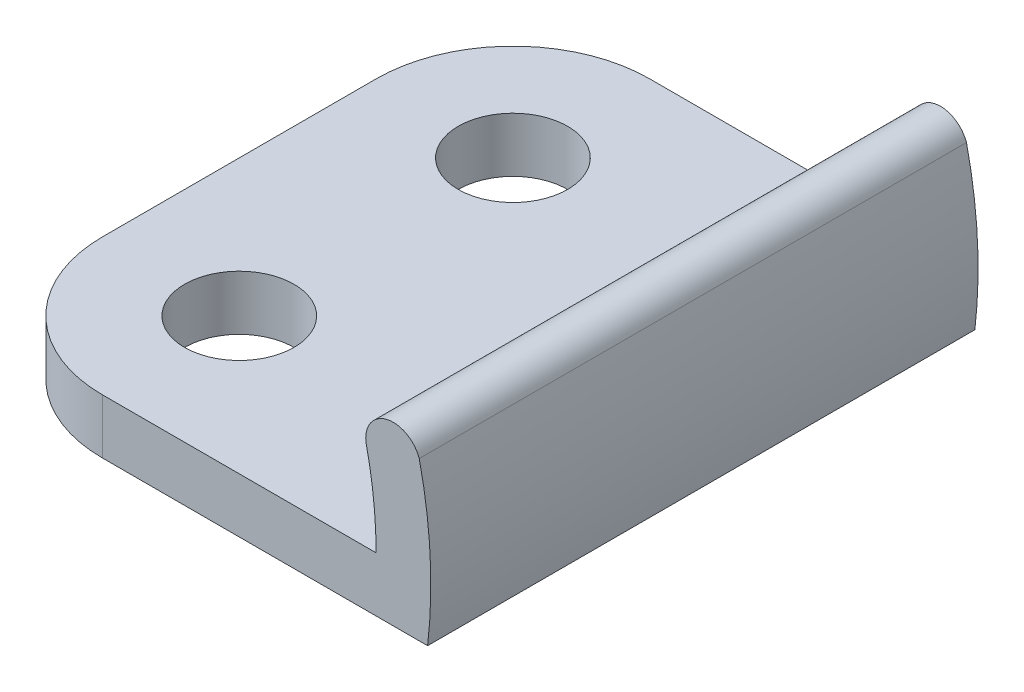
ISO-10303-21;
HEADER;
FILE_DESCRIPTION(('STEP AP214'),'2;1');
FILE_NAME('part.step','',(''),(''),'','','');
FILE_SCHEMA(('AUTOMOTIVE_DESIGN { 1 0 10303 214 1 1 1 1 }'));
ENDSEC;
DATA;
#1=APPLICATION_CONTEXT('core data for automotive mechanical design processes');
#2=APPLICATION_PROTOCOL_DEFINITION('international standard','automotive_design',2000,#1);
#3=PRODUCT_CONTEXT('',#1,'mechanical');
#4=PRODUCT('Part','Part','',(#3));
#5=PRODUCT_RELATED_PRODUCT_CATEGORY('part','',(#4));
#6=PRODUCT_DEFINITION_FORMATION('','',#4);
#7=PRODUCT_DEFINITION_CONTEXT('part definition',#1,'design');
#8=PRODUCT_DEFINITION('design','',#6,#7);
#9=PRODUCT_DEFINITION_SHAPE('','',#8);
#10=(LENGTH_UNIT() NAMED_UNIT(*) SI_UNIT(.MILLI.,.METRE.));
#11=(NAMED_UNIT(*) PLANE_ANGLE_UNIT() SI_UNIT($,.RADIAN.));
#12=(NAMED_UNIT(*) SI_UNIT($,.STERADIAN.) SOLID_ANGLE_UNIT());
#13=UNCERTAINTY_MEASURE_WITH_UNIT(LENGTH_MEASURE(1.E-05),#10,'distance_accuracy_value','');
#14=(GEOMETRIC_REPRESENTATION_CONTEXT(3) GLOBAL_UNCERTAINTY_ASSIGNED_CONTEXT((#13)) GLOBAL_UNIT_ASSIGNED_CONTEXT((#10,
#11,#12)) REPRESENTATION_CONTEXT('',''));
#15=CARTESIAN_POINT('',(0.,0.,0.));
#16=DIRECTION('',(0.,0.,1.));
#17=DIRECTION('',(1.,0.,0.));
#18=AXIS2_PLACEMENT_3D('',#15,#16,#17);
#19=CARTESIAN_POINT('',(15.6268580512046,5.43928042067182,0.));
#20=DIRECTION('',(0.,0.,1.));
#21=DIRECTION('',(1.,0.,0.));
#22=AXIS2_PLACEMENT_3D('',#19,#20,#21);
#23=CYLINDRICAL_SURFACE('',#22,1.00613744918093);
#24=CARTESIAN_POINT('',(15.6268580512046,5.43928042067182,20.));
#25=DIRECTION('',(0.,0.,1.));
#26=DIRECTION('',(1.,0.,0.));
#27=AXIS2_PLACEMENT_3D('',#24,#25,#26);
#28=CIRCLE('',#27,1.00613744918093);
#29=CARTESIAN_POINT('',(16.5759885114296,5.77314257204171,20.));
#30=VERTEX_POINT('',#29);
#31=CARTESIAN_POINT('',(14.6276441346565,5.32144954347464,20.));
#32=VERTEX_POINT('',#31);
#33=EDGE_CURVE('E161',#30,#32,#28,.T.);
#34=ORIENTED_EDGE('',*,*,#33,.F.);
#35=DIRECTION('',(0.,0.,1.));
#36=VECTOR('',#35,1.);
#37=CARTESIAN_POINT('',(16.5759885114296,5.77314257204155,0.));
#38=LINE('',#37,#36);
#39=CARTESIAN_POINT('',(16.5759885114296,5.77314257204171,0.));
#40=VERTEX_POINT('',#39);
#41=EDGE_CURVE('E125',#40,#30,#38,.T.);
#42=ORIENTED_EDGE('',*,*,#41,.F.);
#43=CARTESIAN_POINT('',(15.6268580512046,5.43928042067182,0.));
#44=DIRECTION('',(0.,0.,1.));
#45=DIRECTION('',(1.,0.,0.));
#46=AXIS2_PLACEMENT_3D('',#43,#44,#45);
#47=CIRCLE('',#46,1.00613744918093);
#48=CARTESIAN_POINT('',(14.6276441346566,5.32144954347459,0.));
#49=VERTEX_POINT('',#48);
#50=EDGE_CURVE('E91',#40,#49,#47,.T.);
#51=ORIENTED_EDGE('',*,*,#50,.T.);
#52=DIRECTION('',(0.,0.,1.));
#53=VECTOR('',#52,1.);
#54=CARTESIAN_POINT('',(14.6276441346565,5.32144954347478,0.));
#55=LINE('',#54,#53);
#56=EDGE_CURVE('E122',#49,#32,#55,.T.);
#57=ORIENTED_EDGE('',*,*,#56,.T.);
#58=EDGE_LOOP('',(#34,#42,#51,#57));
#59=FACE_BOUND('',#58,.T.);
#60=ADVANCED_FACE('F17',(#59),#23,.T.);
#61=CARTESIAN_POINT('',(0.,2.,0.));
#62=DIRECTION('',(0.,0.,1.));
#63=DIRECTION('',(1.,0.,0.));
#64=AXIS2_PLACEMENT_3D('',#61,#62,#63);
#65=CYLINDRICAL_SURFACE('',#64,15.);
#66=DIRECTION('',(0.,0.,1.));
#67=VECTOR('',#66,1.);
#68=CARTESIAN_POINT('',(15.,2.,0.));
#69=LINE('',#68,#67);
#70=CARTESIAN_POINT('',(15.,2.,20.));
#71=VERTEX_POINT('',#70);
#72=CARTESIAN_POINT('',(15.,2.,0.));
#73=VERTEX_POINT('',#72);
#74=EDGE_CURVE('E92',#71,#73,#69,.F.);
#75=ORIENTED_EDGE('',*,*,#74,.F.);
#76=CARTESIAN_POINT('',(0.,2.,20.));
#77=DIRECTION('',(0.,0.,1.));
#78=DIRECTION('',(1.,0.,0.));
#79=AXIS2_PLACEMENT_3D('',#76,#77,#78);
#80=CIRCLE('',#79,15.);
#81=EDGE_CURVE('E157',#32,#71,#80,.F.);
#82=ORIENTED_EDGE('',*,*,#81,.F.);
#83=ORIENTED_EDGE('',*,*,#56,.F.);
#84=CARTESIAN_POINT('',(0.,2.,0.));
#85=DIRECTION('',(0.,0.,1.));
#86=DIRECTION('',(1.,0.,0.));
#87=AXIS2_PLACEMENT_3D('',#84,#85,#86);
#88=CIRCLE('',#87,15.);
#89=EDGE_CURVE('E171',#49,#73,#88,.F.);
#90=ORIENTED_EDGE('',*,*,#89,.T.);
#91=EDGE_LOOP('',(#75,#82,#83,#90));
#92=FACE_BOUND('',#91,.T.);
#93=ADVANCED_FACE('F182',(#92),#65,.F.);
#94=CARTESIAN_POINT('',(15.,2.,0.));
#95=DIRECTION('',(0.,1.,0.));
#96=DIRECTION('',(0.,0.,1.));
#97=AXIS2_PLACEMENT_3D('',#94,#95,#96);
#98=PLANE('',#97);
#99=CARTESIAN_POINT('',(5.,2.,15.));
#100=DIRECTION('',(0.,1.,0.));
#101=DIRECTION('',(0.,0.,1.));
#102=AXIS2_PLACEMENT_3D('',#99,#100,#101);
#103=CIRCLE('',#102,2.);
#104=CARTESIAN_POINT('',(5.,2.,17.));
#105=VERTEX_POINT('',#104);
#106=EDGE_CURVE('E112',#105,#105,#103,.F.);
#107=ORIENTED_EDGE('',*,*,#106,.T.);
#108=EDGE_LOOP('',(#107));
#109=FACE_BOUND('',#108,.T.);
#110=CARTESIAN_POINT('',(5.,2.,5.));
#111=DIRECTION('',(0.,1.,0.));
#112=DIRECTION('',(0.,0.,1.));
#113=AXIS2_PLACEMENT_3D('',#110,#111,#112);
#114=CIRCLE('',#113,2.);
#115=CARTESIAN_POINT('',(5.,2.,7.));
#116=VERTEX_POINT('',#115);
#117=EDGE_CURVE('E105',#116,#116,#114,.F.);
#118=ORIENTED_EDGE('',*,*,#117,.T.);
#119=EDGE_LOOP('',(#118));
#120=FACE_BOUND('',#119,.T.);
#121=ORIENTED_EDGE('',*,*,#74,.T.);
#122=DIRECTION('',(1.,0.,0.));
#123=VECTOR('',#122,1.);
#124=CARTESIAN_POINT('',(9.31381759573851,2.,0.));
#125=LINE('',#124,#123);
#126=CARTESIAN_POINT('',(5.,2.,0.));
#127=VERTEX_POINT('',#126);
#128=EDGE_CURVE('E87',#73,#127,#125,.F.);
#129=ORIENTED_EDGE('',*,*,#128,.T.);
#130=CARTESIAN_POINT('',(5.,2.,5.));
#131=DIRECTION('',(0.,1.,0.));
#132=DIRECTION('',(0.,0.,1.));
#133=AXIS2_PLACEMENT_3D('',#130,#131,#132);
#134=CIRCLE('',#133,5.);
#135=CARTESIAN_POINT('',(0.,2.,5.));
#136=VERTEX_POINT('',#135);
#137=EDGE_CURVE('E20',#136,#127,#134,.F.);
#138=ORIENTED_EDGE('',*,*,#137,.F.);
#139=DIRECTION('',(0.,0.,1.));
#140=VECTOR('',#139,1.);
#141=CARTESIAN_POINT('',(0.,2.,0.));
#142=LINE('',#141,#140);
#143=CARTESIAN_POINT('',(0.,2.,15.));
#144=VERTEX_POINT('',#143);
#145=EDGE_CURVE('E85',#144,#136,#142,.F.);
#146=ORIENTED_EDGE('',*,*,#145,.F.);
#147=CARTESIAN_POINT('',(5.,2.,15.));
#148=DIRECTION('',(0.,1.,0.));
#149=DIRECTION('',(0.,0.,1.));
#150=AXIS2_PLACEMENT_3D('',#147,#148,#149);
#151=CIRCLE('',#150,5.);
#152=CARTESIAN_POINT('',(5.,2.,20.));
#153=VERTEX_POINT('',#152);
#154=EDGE_CURVE('E153',#153,#144,#151,.F.);
#155=ORIENTED_EDGE('',*,*,#154,.F.);
#156=DIRECTION('',(1.,0.,0.));
#157=VECTOR('',#156,1.);
#158=CARTESIAN_POINT('',(9.31381759573851,2.,20.));
#159=LINE('',#158,#157);
#160=EDGE_CURVE('E156',#71,#153,#159,.F.);
#161=ORIENTED_EDGE('',*,*,#160,.F.);
#162=EDGE_LOOP('',(#121,#129,#138,#146,#155,#161));
#163=FACE_BOUND('',#162,.T.);
#164=ADVANCED_FACE('F83',(#109,#120,#163),#98,.T.);
#165=CARTESIAN_POINT('',(5.,0.,5.));
#166=DIRECTION('',(0.,1.,0.));
#167=DIRECTION('',(0.,0.,1.));
#168=AXIS2_PLACEMENT_3D('',#165,#166,#167);
#169=CYLINDRICAL_SURFACE('',#168,5.);
#170=CARTESIAN_POINT('',(5.,0.,5.));
#171=DIRECTION('',(0.,1.,0.));
#172=DIRECTION('',(0.,0.,1.));
#173=AXIS2_PLACEMENT_3D('',#170,#171,#172);
#174=CIRCLE('',#173,5.);
#175=CARTESIAN_POINT('',(0.,0.,5.));
#176=VERTEX_POINT('',#175);
#177=CARTESIAN_POINT('',(5.,0.,0.));
#178=VERTEX_POINT('',#177);
#179=EDGE_CURVE('E97',#176,#178,#174,.F.);
#180=ORIENTED_EDGE('',*,*,#179,.F.);
#181=DIRECTION('',(0.,1.,0.));
#182=VECTOR('',#181,1.);
#183=CARTESIAN_POINT('',(0.,2.,5.));
#184=LINE('',#183,#182);
#185=EDGE_CURVE('E94',#136,#176,#184,.F.);
#186=ORIENTED_EDGE('',*,*,#185,.F.);
#187=ORIENTED_EDGE('',*,*,#137,.T.);
#188=DIRECTION('',(0.,1.,0.));
#189=VECTOR('',#188,1.);
#190=CARTESIAN_POINT('',(5.,1.56643939883788,0.));
#191=LINE('',#190,#189);
#192=EDGE_CURVE('E118',#127,#178,#191,.F.);
#193=ORIENTED_EDGE('',*,*,#192,.T.);
#194=EDGE_LOOP('',(#180,#186,#187,#193));
#195=FACE_BOUND('',#194,.T.);
#196=ADVANCED_FACE('F95',(#195),#169,.T.);
#197=CARTESIAN_POINT('',(9.31381759573851,1.56643939883788,0.));
#198=DIRECTION('',(0.,0.,1.));
#199=DIRECTION('',(1.,0.,0.));
#200=AXIS2_PLACEMENT_3D('',#197,#198,#199);
#201=PLANE('',#200);
#202=ORIENTED_EDGE('',*,*,#128,.F.);
#203=ORIENTED_EDGE('',*,*,#89,.F.);
#204=ORIENTED_EDGE('',*,*,#50,.F.);
#205=CARTESIAN_POINT('',(0.,2.,0.));
#206=DIRECTION('',(0.,0.,1.));
#207=DIRECTION('',(1.,0.,0.));
#208=AXIS2_PLACEMENT_3D('',#205,#206,#207);
#209=CIRCLE('',#208,17.);
#210=CARTESIAN_POINT('',(16.8819430161341,0.,0.));
#211=VERTEX_POINT('',#210);
#212=EDGE_CURVE('E128',#211,#40,#209,.T.);
#213=ORIENTED_EDGE('',*,*,#212,.F.);
#214=DIRECTION('',(1.,0.,0.));
#215=VECTOR('',#214,1.);
#216=CARTESIAN_POINT('',(0.,0.,0.));
#217=LINE('',#216,#215);
#218=EDGE_CURVE('E145',#178,#211,#217,.T.);
#219=ORIENTED_EDGE('',*,*,#218,.F.);
#220=ORIENTED_EDGE('',*,*,#192,.F.);
#221=EDGE_LOOP('',(#202,#203,#204,#213,#219,#220));
#222=FACE_BOUND('',#221,.T.);
#223=ADVANCED_FACE('F183',(#222),#201,.F.);
#224=CARTESIAN_POINT('',(0.,2.,0.));
#225=DIRECTION('',(0.,0.,1.));
#226=DIRECTION('',(1.,0.,0.));
#227=AXIS2_PLACEMENT_3D('',#224,#225,#226);
#228=CYLINDRICAL_SURFACE('',#227,17.);
#229=CARTESIAN_POINT('',(0.,2.,20.));
#230=DIRECTION('',(0.,0.,1.));
#231=DIRECTION('',(1.,0.,0.));
#232=AXIS2_PLACEMENT_3D('',#229,#230,#231);
#233=CIRCLE('',#232,17.);
#234=CARTESIAN_POINT('',(16.8819430161341,0.,20.));
#235=VERTEX_POINT('',#234);
#236=EDGE_CURVE('E127',#235,#30,#233,.T.);
#237=ORIENTED_EDGE('',*,*,#236,.F.);
#238=DIRECTION('',(0.,0.,-1.));
#239=VECTOR('',#238,1.);
#240=CARTESIAN_POINT('',(16.8819430161341,0.,0.));
#241=LINE('',#240,#239);
#242=EDGE_CURVE('E187',#211,#235,#241,.F.);
#243=ORIENTED_EDGE('',*,*,#242,.F.);
#244=ORIENTED_EDGE('',*,*,#212,.T.);
#245=ORIENTED_EDGE('',*,*,#41,.T.);
#246=EDGE_LOOP('',(#237,#243,#244,#245));
#247=FACE_BOUND('',#246,.T.);
#248=ADVANCED_FACE('F212',(#247),#228,.T.);
#249=CARTESIAN_POINT('',(9.31381759573851,1.56643939883788,20.));
#250=DIRECTION('',(0.,0.,1.));
#251=DIRECTION('',(1.,0.,0.));
#252=AXIS2_PLACEMENT_3D('',#249,#250,#251);
#253=PLANE('',#252);
#254=ORIENTED_EDGE('',*,*,#81,.T.);
#255=ORIENTED_EDGE('',*,*,#160,.T.);
#256=DIRECTION('',(0.,1.,0.));
#257=VECTOR('',#256,1.);
#258=CARTESIAN_POINT('',(5.,0.,20.));
#259=LINE('',#258,#257);
#260=CARTESIAN_POINT('',(5.,0.,20.));
#261=VERTEX_POINT('',#260);
#262=EDGE_CURVE('E101',#261,#153,#259,.T.);
#263=ORIENTED_EDGE('',*,*,#262,.F.);
#264=DIRECTION('',(1.,0.,0.));
#265=VECTOR('',#264,1.);
#266=CARTESIAN_POINT('',(0.,0.,20.));
#267=LINE('',#266,#265);
#268=EDGE_CURVE('E142',#235,#261,#267,.F.);
#269=ORIENTED_EDGE('',*,*,#268,.F.);
#270=ORIENTED_EDGE('',*,*,#236,.T.);
#271=ORIENTED_EDGE('',*,*,#33,.T.);
#272=EDGE_LOOP('',(#254,#255,#263,#269,#270,#271));
#273=FACE_BOUND('',#272,.T.);
#274=ADVANCED_FACE('F208',(#273),#253,.T.);
#275=CARTESIAN_POINT('',(5.,0.,15.));
#276=DIRECTION('',(0.,1.,0.));
#277=DIRECTION('',(0.,0.,1.));
#278=AXIS2_PLACEMENT_3D('',#275,#276,#277);
#279=CYLINDRICAL_SURFACE('',#278,5.);
#280=CARTESIAN_POINT('',(5.,0.,15.));
#281=DIRECTION('',(0.,1.,0.));
#282=DIRECTION('',(0.,0.,1.));
#283=AXIS2_PLACEMENT_3D('',#280,#281,#282);
#284=CIRCLE('',#283,5.);
#285=CARTESIAN_POINT('',(0.,0.,15.));
#286=VERTEX_POINT('',#285);
#287=EDGE_CURVE('E138',#261,#286,#284,.F.);
#288=ORIENTED_EDGE('',*,*,#287,.F.);
#289=ORIENTED_EDGE('',*,*,#262,.T.);
#290=ORIENTED_EDGE('',*,*,#154,.T.);
#291=DIRECTION('',(0.,1.,0.));
#292=VECTOR('',#291,1.);
#293=CARTESIAN_POINT('',(0.,2.,15.));
#294=LINE('',#293,#292);
#295=EDGE_CURVE('E36',#286,#144,#294,.T.);
#296=ORIENTED_EDGE('',*,*,#295,.F.);
#297=EDGE_LOOP('',(#288,#289,#290,#296));
#298=FACE_BOUND('',#297,.T.);
#299=ADVANCED_FACE('F206',(#298),#279,.T.);
#300=CARTESIAN_POINT('',(0.,2.,0.));
#301=DIRECTION('',(-1.,0.,0.));
#302=DIRECTION('',(0.,0.,1.));
#303=AXIS2_PLACEMENT_3D('',#300,#301,#302);
#304=PLANE('',#303);
#305=ORIENTED_EDGE('',*,*,#295,.T.);
#306=ORIENTED_EDGE('',*,*,#145,.T.);
#307=ORIENTED_EDGE('',*,*,#185,.T.);
#308=DIRECTION('',(0.,0.,-1.));
#309=VECTOR('',#308,1.);
#310=CARTESIAN_POINT('',(0.,0.,0.));
#311=LINE('',#310,#309);
#312=EDGE_CURVE('E135',#286,#176,#311,.T.);
#313=ORIENTED_EDGE('',*,*,#312,.F.);
#314=EDGE_LOOP('',(#305,#306,#307,#313));
#315=FACE_BOUND('',#314,.T.);
#316=ADVANCED_FACE('F103',(#315),#304,.T.);
#317=CARTESIAN_POINT('',(5.,-25.028566582729,5.));
#318=DIRECTION('',(0.,1.,0.));
#319=DIRECTION('',(0.,0.,1.));
#320=AXIS2_PLACEMENT_3D('',#317,#318,#319);
#321=CYLINDRICAL_SURFACE('',#320,2.);
#322=ORIENTED_EDGE('',*,*,#117,.F.);
#323=EDGE_LOOP('',(#322));
#324=FACE_BOUND('',#323,.T.);
#325=CARTESIAN_POINT('',(5.,0.,5.));
#326=DIRECTION('',(0.,1.,0.));
#327=DIRECTION('',(0.,0.,1.));
#328=AXIS2_PLACEMENT_3D('',#325,#326,#327);
#329=CIRCLE('',#328,2.);
#330=CARTESIAN_POINT('',(5.,0.,7.));
#331=VERTEX_POINT('',#330);
#332=EDGE_CURVE('E27',#331,#331,#329,.T.);
#333=ORIENTED_EDGE('',*,*,#332,.F.);
#334=EDGE_LOOP('',(#333));
#335=FACE_BOUND('',#334,.T.);
#336=ADVANCED_FACE('F229',(#324,#335),#321,.F.);
#337=CARTESIAN_POINT('',(5.,-25.028566582729,15.));
#338=DIRECTION('',(0.,1.,0.));
#339=DIRECTION('',(0.,0.,1.));
#340=AXIS2_PLACEMENT_3D('',#337,#338,#339);
#341=CYLINDRICAL_SURFACE('',#340,2.);
#342=ORIENTED_EDGE('',*,*,#106,.F.);
#343=EDGE_LOOP('',(#342));
#344=FACE_BOUND('',#343,.T.);
#345=CARTESIAN_POINT('',(5.,0.,15.));
#346=DIRECTION('',(0.,1.,0.));
#347=DIRECTION('',(0.,0.,1.));
#348=AXIS2_PLACEMENT_3D('',#345,#346,#347);
#349=CIRCLE('',#348,2.);
#350=CARTESIAN_POINT('',(5.,0.,17.));
#351=VERTEX_POINT('',#350);
#352=EDGE_CURVE('E11',#351,#351,#349,.T.);
#353=ORIENTED_EDGE('',*,*,#352,.F.);
#354=EDGE_LOOP('',(#353));
#355=FACE_BOUND('',#354,.T.);
#356=ADVANCED_FACE('F223',(#344,#355),#341,.F.);
#357=CARTESIAN_POINT('',(0.,0.,0.));
#358=DIRECTION('',(0.,-1.,0.));
#359=DIRECTION('',(0.,0.,-1.));
#360=AXIS2_PLACEMENT_3D('',#357,#358,#359);
#361=PLANE('',#360);
#362=ORIENTED_EDGE('',*,*,#352,.T.);
#363=EDGE_LOOP('',(#362));
#364=FACE_BOUND('',#363,.T.);
#365=ORIENTED_EDGE('',*,*,#332,.T.);
#366=EDGE_LOOP('',(#365));
#367=FACE_BOUND('',#366,.T.);
#368=ORIENTED_EDGE('',*,*,#287,.T.);
#369=ORIENTED_EDGE('',*,*,#312,.T.);
#370=ORIENTED_EDGE('',*,*,#179,.T.);
#371=ORIENTED_EDGE('',*,*,#218,.T.);
#372=ORIENTED_EDGE('',*,*,#242,.T.);
#373=ORIENTED_EDGE('',*,*,#268,.T.);
#374=EDGE_LOOP('',(#368,#369,#370,#371,#372,#373));
#375=FACE_BOUND('',#374,.T.);
#376=ADVANCED_FACE('F204',(#364,#367,#375),#361,.T.);
#377=CLOSED_SHELL('',(#60,#93,#164,#196,#223,#248,#274,#299,#316,#336,#356,#376));
#378=MANIFOLD_SOLID_BREP('B1',#377);
#379=ADVANCED_BREP_SHAPE_REPRESENTATION('',(#18,#378),#14);
#380=SHAPE_DEFINITION_REPRESENTATION(#9,#379);
ENDSEC;
END-ISO-10303-21;
